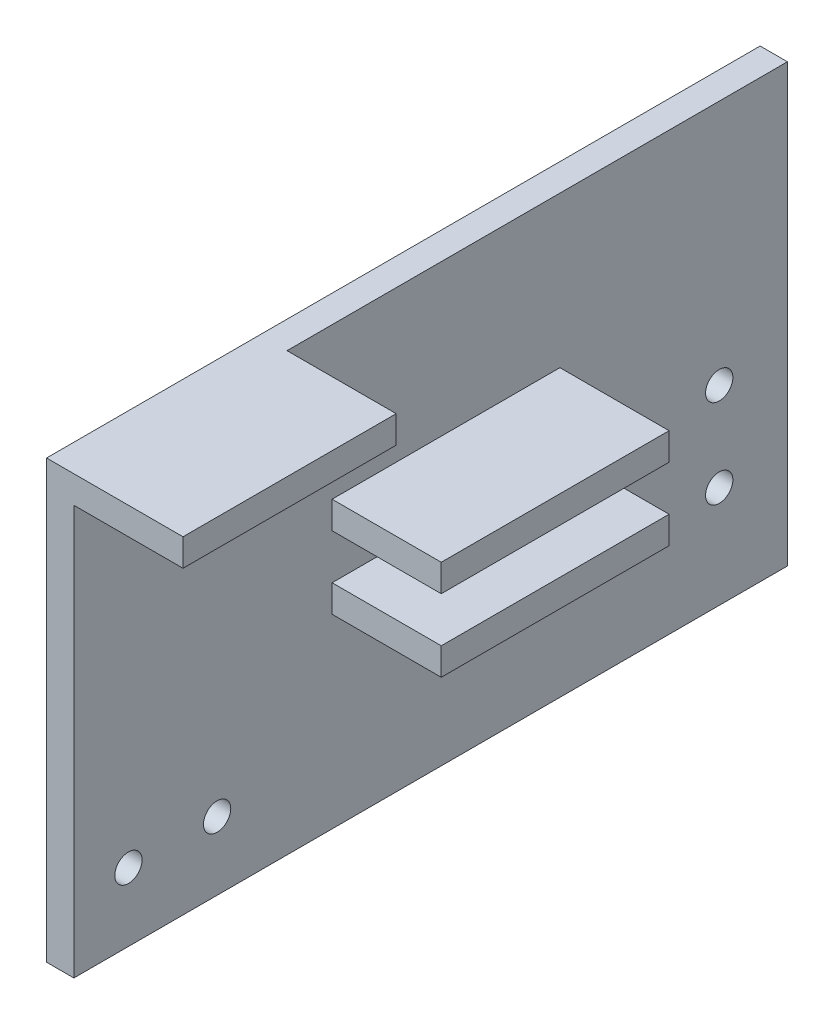
ISO-10303-21;
HEADER;
FILE_DESCRIPTION(('STEP AP214'),'2;1');
FILE_NAME('part.step','',(''),(''),'','','');
FILE_SCHEMA(('AUTOMOTIVE_DESIGN { 1 0 10303 214 1 1 1 1 }'));
ENDSEC;
DATA;
#1=APPLICATION_CONTEXT('core data for automotive mechanical design processes');
#2=APPLICATION_PROTOCOL_DEFINITION('international standard','automotive_design',2000,#1);
#3=PRODUCT_CONTEXT('',#1,'mechanical');
#4=PRODUCT('Part','Part','',(#3));
#5=PRODUCT_RELATED_PRODUCT_CATEGORY('part','',(#4));
#6=PRODUCT_DEFINITION_FORMATION('','',#4);
#7=PRODUCT_DEFINITION_CONTEXT('part definition',#1,'design');
#8=PRODUCT_DEFINITION('design','',#6,#7);
#9=PRODUCT_DEFINITION_SHAPE('','',#8);
#10=(LENGTH_UNIT() NAMED_UNIT(*) SI_UNIT(.MILLI.,.METRE.));
#11=(NAMED_UNIT(*) PLANE_ANGLE_UNIT() SI_UNIT($,.RADIAN.));
#12=(NAMED_UNIT(*) SI_UNIT($,.STERADIAN.) SOLID_ANGLE_UNIT());
#13=UNCERTAINTY_MEASURE_WITH_UNIT(LENGTH_MEASURE(1.E-05),#10,'distance_accuracy_value','');
#14=(GEOMETRIC_REPRESENTATION_CONTEXT(3) GLOBAL_UNCERTAINTY_ASSIGNED_CONTEXT((#13)) GLOBAL_UNIT_ASSIGNED_CONTEXT((#10,
#11,#12)) REPRESENTATION_CONTEXT('',''));
#15=CARTESIAN_POINT('',(0.,0.,0.));
#16=DIRECTION('',(0.,0.,1.));
#17=DIRECTION('',(1.,0.,0.));
#18=AXIS2_PLACEMENT_3D('',#15,#16,#17);
#19=CARTESIAN_POINT('',(2.,14.73202564,0.));
#20=DIRECTION('',(0.,-1.,0.));
#21=DIRECTION('',(0.,0.,-1.));
#22=AXIS2_PLACEMENT_3D('',#19,#20,#21);
#23=PLANE('',#22);
#24=DIRECTION('',(0.,0.,1.));
#25=VECTOR('',#24,1.);
#26=CARTESIAN_POINT('',(0.,14.73202564,0.));
#27=LINE('',#26,#25);
#28=CARTESIAN_POINT('',(0.,14.73202564,-52.3));
#29=VERTEX_POINT('',#28);
#30=CARTESIAN_POINT('',(0.,14.73202564,0.));
#31=VERTEX_POINT('',#30);
#32=EDGE_CURVE('E324',#29,#31,#27,.T.);
#33=ORIENTED_EDGE('',*,*,#32,.T.);
#34=DIRECTION('',(-1.,0.,0.));
#35=VECTOR('',#34,1.);
#36=CARTESIAN_POINT('',(2.,14.73202564,0.));
#37=LINE('',#36,#35);
#38=CARTESIAN_POINT('',(10.,14.73202564,0.));
#39=VERTEX_POINT('',#38);
#40=EDGE_CURVE('E11',#39,#31,#37,.T.);
#41=ORIENTED_EDGE('',*,*,#40,.F.);
#42=DIRECTION('',(0.,0.,1.));
#43=VECTOR('',#42,1.);
#44=CARTESIAN_POINT('',(10.,14.73202564,0.));
#45=LINE('',#44,#43);
#46=CARTESIAN_POINT('',(10.,14.73202564,-15.625));
#47=VERTEX_POINT('',#46);
#48=EDGE_CURVE('E249',#47,#39,#45,.T.);
#49=ORIENTED_EDGE('',*,*,#48,.F.);
#50=DIRECTION('',(-1.,0.,0.));
#51=VECTOR('',#50,1.);
#52=CARTESIAN_POINT('',(10.,14.73202564,-15.625));
#53=LINE('',#52,#51);
#54=CARTESIAN_POINT('',(2.,14.73202564,-15.625));
#55=VERTEX_POINT('',#54);
#56=EDGE_CURVE('E266',#47,#55,#53,.T.);
#57=ORIENTED_EDGE('',*,*,#56,.T.);
#58=DIRECTION('',(0.,0.,1.));
#59=VECTOR('',#58,1.);
#60=CARTESIAN_POINT('',(2.,14.73202564,0.));
#61=LINE('',#60,#59);
#62=CARTESIAN_POINT('',(2.,14.73202564,-52.3));
#63=VERTEX_POINT('',#62);
#64=EDGE_CURVE('E295',#63,#55,#61,.T.);
#65=ORIENTED_EDGE('',*,*,#64,.F.);
#66=DIRECTION('',(-1.,0.,0.));
#67=VECTOR('',#66,1.);
#68=CARTESIAN_POINT('',(2.,14.73202564,-52.3));
#69=LINE('',#68,#67);
#70=EDGE_CURVE('E308',#63,#29,#69,.T.);
#71=ORIENTED_EDGE('',*,*,#70,.T.);
#72=EDGE_LOOP('',(#33,#41,#49,#57,#65,#71));
#73=FACE_BOUND('',#72,.T.);
#74=ADVANCED_FACE('F41',(#73),#23,.F.);
#75=CARTESIAN_POINT('',(2.,0.,0.));
#76=DIRECTION('',(0.,0.,-1.));
#77=DIRECTION('',(0.,1.,0.));
#78=AXIS2_PLACEMENT_3D('',#75,#76,#77);
#79=PLANE('',#78);
#80=DIRECTION('',(0.,-1.,0.));
#81=VECTOR('',#80,1.);
#82=CARTESIAN_POINT('',(0.,0.,0.));
#83=LINE('',#82,#81);
#84=CARTESIAN_POINT('',(0.,-17.27497436,0.));
#85=VERTEX_POINT('',#84);
#86=EDGE_CURVE('E327',#31,#85,#83,.T.);
#87=ORIENTED_EDGE('',*,*,#86,.T.);
#88=DIRECTION('',(-1.,0.,0.));
#89=VECTOR('',#88,1.);
#90=CARTESIAN_POINT('',(2.,-17.27497436,0.));
#91=LINE('',#90,#89);
#92=CARTESIAN_POINT('',(2.,-17.27497436,0.));
#93=VERTEX_POINT('',#92);
#94=EDGE_CURVE('E50',#93,#85,#91,.T.);
#95=ORIENTED_EDGE('',*,*,#94,.F.);
#96=DIRECTION('',(0.,-1.,0.));
#97=VECTOR('',#96,1.);
#98=CARTESIAN_POINT('',(2.,0.,0.));
#99=LINE('',#98,#97);
#100=CARTESIAN_POINT('',(2.,12.73202564,0.));
#101=VERTEX_POINT('',#100);
#102=EDGE_CURVE('E299',#101,#93,#99,.T.);
#103=ORIENTED_EDGE('',*,*,#102,.F.);
#104=DIRECTION('',(-1.,0.,0.));
#105=VECTOR('',#104,1.);
#106=CARTESIAN_POINT('',(10.,12.73202564,0.));
#107=LINE('',#106,#105);
#108=CARTESIAN_POINT('',(10.,12.73202564,0.));
#109=VERTEX_POINT('',#108);
#110=EDGE_CURVE('E263',#109,#101,#107,.T.);
#111=ORIENTED_EDGE('',*,*,#110,.F.);
#112=DIRECTION('',(0.,-1.,0.));
#113=VECTOR('',#112,1.);
#114=CARTESIAN_POINT('',(10.,0.,0.));
#115=LINE('',#114,#113);
#116=EDGE_CURVE('E253',#39,#109,#115,.T.);
#117=ORIENTED_EDGE('',*,*,#116,.F.);
#118=ORIENTED_EDGE('',*,*,#40,.T.);
#119=EDGE_LOOP('',(#87,#95,#103,#111,#117,#118));
#120=FACE_BOUND('',#119,.T.);
#121=ADVANCED_FACE('F369',(#120),#79,.F.);
#122=CARTESIAN_POINT('',(2.,-17.27497436,0.));
#123=DIRECTION('',(0.,1.,0.));
#124=DIRECTION('',(0.,0.,1.));
#125=AXIS2_PLACEMENT_3D('',#122,#123,#124);
#126=PLANE('',#125);
#127=DIRECTION('',(0.,0.,-1.));
#128=VECTOR('',#127,1.);
#129=CARTESIAN_POINT('',(0.,-17.27497436,0.));
#130=LINE('',#129,#128);
#131=CARTESIAN_POINT('',(0.,-17.27497436,-52.3));
#132=VERTEX_POINT('',#131);
#133=EDGE_CURVE('E330',#85,#132,#130,.T.);
#134=ORIENTED_EDGE('',*,*,#133,.T.);
#135=DIRECTION('',(-1.,0.,0.));
#136=VECTOR('',#135,1.);
#137=CARTESIAN_POINT('',(2.,-17.27497436,-52.3));
#138=LINE('',#137,#136);
#139=CARTESIAN_POINT('',(2.,-17.27497436,-52.3));
#140=VERTEX_POINT('',#139);
#141=EDGE_CURVE('E338',#140,#132,#138,.T.);
#142=ORIENTED_EDGE('',*,*,#141,.F.);
#143=DIRECTION('',(0.,0.,-1.));
#144=VECTOR('',#143,1.);
#145=CARTESIAN_POINT('',(2.,-17.27497436,0.));
#146=LINE('',#145,#144);
#147=EDGE_CURVE('E302',#93,#140,#146,.T.);
#148=ORIENTED_EDGE('',*,*,#147,.F.);
#149=ORIENTED_EDGE('',*,*,#94,.T.);
#150=EDGE_LOOP('',(#134,#142,#148,#149));
#151=FACE_BOUND('',#150,.T.);
#152=ADVANCED_FACE('F347',(#151),#126,.F.);
#153=CARTESIAN_POINT('',(2.,-12.27497436,-4.00000000000001));
#154=DIRECTION('',(-1.,0.,0.));
#155=DIRECTION('',(0.,0.,1.));
#156=AXIS2_PLACEMENT_3D('',#153,#154,#155);
#157=CYLINDRICAL_SURFACE('',#156,1.);
#158=CARTESIAN_POINT('',(2.,-12.27497436,-4.00000000000001));
#159=DIRECTION('',(1.,0.,0.));
#160=DIRECTION('',(0.,0.,-1.));
#161=AXIS2_PLACEMENT_3D('',#158,#159,#160);
#162=CIRCLE('',#161,1.);
#163=CARTESIAN_POINT('',(2.,-12.27497436,-5.00000000000001));
#164=VERTEX_POINT('',#163);
#165=EDGE_CURVE('E291',#164,#164,#162,.T.);
#166=ORIENTED_EDGE('',*,*,#165,.T.);
#167=EDGE_LOOP('',(#166));
#168=FACE_BOUND('',#167,.T.);
#169=CARTESIAN_POINT('',(0.,-12.27497436,-4.00000000000001));
#170=DIRECTION('',(1.,0.,0.));
#171=DIRECTION('',(0.,0.,-1.));
#172=AXIS2_PLACEMENT_3D('',#169,#170,#171);
#173=CIRCLE('',#172,1.);
#174=CARTESIAN_POINT('',(0.,-12.27497436,-5.00000000000001));
#175=VERTEX_POINT('',#174);
#176=EDGE_CURVE('E320',#175,#175,#173,.T.);
#177=ORIENTED_EDGE('',*,*,#176,.F.);
#178=EDGE_LOOP('',(#177));
#179=FACE_BOUND('',#178,.T.);
#180=ADVANCED_FACE('F397',(#168,#179),#157,.F.);
#181=CARTESIAN_POINT('',(2.,-12.27497436,-10.5));
#182=DIRECTION('',(-1.,0.,0.));
#183=DIRECTION('',(0.,0.,1.));
#184=AXIS2_PLACEMENT_3D('',#181,#182,#183);
#185=CYLINDRICAL_SURFACE('',#184,1.);
#186=CARTESIAN_POINT('',(2.,-12.27497436,-10.5));
#187=DIRECTION('',(1.,0.,0.));
#188=DIRECTION('',(0.,0.,-1.));
#189=AXIS2_PLACEMENT_3D('',#186,#187,#188);
#190=CIRCLE('',#189,1.);
#191=CARTESIAN_POINT('',(2.,-12.27497436,-11.5));
#192=VERTEX_POINT('',#191);
#193=EDGE_CURVE('E287',#192,#192,#190,.T.);
#194=ORIENTED_EDGE('',*,*,#193,.T.);
#195=EDGE_LOOP('',(#194));
#196=FACE_BOUND('',#195,.T.);
#197=CARTESIAN_POINT('',(0.,-12.27497436,-10.5));
#198=DIRECTION('',(1.,0.,0.));
#199=DIRECTION('',(0.,0.,-1.));
#200=AXIS2_PLACEMENT_3D('',#197,#198,#199);
#201=CIRCLE('',#200,1.);
#202=CARTESIAN_POINT('',(0.,-12.27497436,-11.5));
#203=VERTEX_POINT('',#202);
#204=EDGE_CURVE('E316',#203,#203,#201,.T.);
#205=ORIENTED_EDGE('',*,*,#204,.F.);
#206=EDGE_LOOP('',(#205));
#207=FACE_BOUND('',#206,.T.);
#208=ADVANCED_FACE('F400',(#196,#207),#185,.F.);
#209=CARTESIAN_POINT('',(2.,-9.79999999999999,-47.3));
#210=DIRECTION('',(-1.,0.,0.));
#211=DIRECTION('',(0.,0.,1.));
#212=AXIS2_PLACEMENT_3D('',#209,#210,#211);
#213=CYLINDRICAL_SURFACE('',#212,0.999999999999998);
#214=CARTESIAN_POINT('',(2.,-9.79999999999999,-47.3));
#215=DIRECTION('',(1.,0.,0.));
#216=DIRECTION('',(0.,0.,-1.));
#217=AXIS2_PLACEMENT_3D('',#214,#215,#216);
#218=CIRCLE('',#217,0.999999999999998);
#219=CARTESIAN_POINT('',(2.,-9.79999999999999,-48.3));
#220=VERTEX_POINT('',#219);
#221=EDGE_CURVE('E282',#220,#220,#218,.T.);
#222=ORIENTED_EDGE('',*,*,#221,.T.);
#223=EDGE_LOOP('',(#222));
#224=FACE_BOUND('',#223,.T.);
#225=CARTESIAN_POINT('',(0.,-9.79999999999999,-47.3));
#226=DIRECTION('',(1.,0.,0.));
#227=DIRECTION('',(0.,0.,-1.));
#228=AXIS2_PLACEMENT_3D('',#225,#226,#227);
#229=CIRCLE('',#228,0.999999999999998);
#230=CARTESIAN_POINT('',(0.,-9.79999999999999,-48.3));
#231=VERTEX_POINT('',#230);
#232=EDGE_CURVE('E312',#231,#231,#229,.T.);
#233=ORIENTED_EDGE('',*,*,#232,.F.);
#234=EDGE_LOOP('',(#233));
#235=FACE_BOUND('',#234,.T.);
#236=ADVANCED_FACE('F403',(#224,#235),#213,.F.);
#237=CARTESIAN_POINT('',(2.,-3.3,-47.3));
#238=DIRECTION('',(-1.,0.,0.));
#239=DIRECTION('',(0.,0.,1.));
#240=AXIS2_PLACEMENT_3D('',#237,#238,#239);
#241=CYLINDRICAL_SURFACE('',#240,0.999999999999998);
#242=CARTESIAN_POINT('',(2.,-3.3,-47.3));
#243=DIRECTION('',(1.,0.,0.));
#244=DIRECTION('',(0.,0.,-1.));
#245=AXIS2_PLACEMENT_3D('',#242,#243,#244);
#246=CIRCLE('',#245,0.999999999999998);
#247=CARTESIAN_POINT('',(2.,-3.3,-48.3));
#248=VERTEX_POINT('',#247);
#249=EDGE_CURVE('E278',#248,#248,#246,.T.);
#250=ORIENTED_EDGE('',*,*,#249,.T.);
#251=EDGE_LOOP('',(#250));
#252=FACE_BOUND('',#251,.T.);
#253=CARTESIAN_POINT('',(0.,-3.3,-47.3));
#254=DIRECTION('',(1.,0.,0.));
#255=DIRECTION('',(0.,0.,-1.));
#256=AXIS2_PLACEMENT_3D('',#253,#254,#255);
#257=CIRCLE('',#256,0.999999999999998);
#258=CARTESIAN_POINT('',(0.,-3.3,-48.3));
#259=VERTEX_POINT('',#258);
#260=EDGE_CURVE('E277',#259,#259,#257,.T.);
#261=ORIENTED_EDGE('',*,*,#260,.F.);
#262=EDGE_LOOP('',(#261));
#263=FACE_BOUND('',#262,.T.);
#264=ADVANCED_FACE('F43',(#252,#263),#241,.F.);
#265=CARTESIAN_POINT('',(2.,0.,-52.3));
#266=DIRECTION('',(0.,0.,1.));
#267=DIRECTION('',(1.,0.,0.));
#268=AXIS2_PLACEMENT_3D('',#265,#266,#267);
#269=PLANE('',#268);
#270=DIRECTION('',(0.,1.,0.));
#271=VECTOR('',#270,1.);
#272=CARTESIAN_POINT('',(0.,0.,-52.3));
#273=LINE('',#272,#271);
#274=EDGE_CURVE('E283',#132,#29,#273,.T.);
#275=ORIENTED_EDGE('',*,*,#274,.T.);
#276=ORIENTED_EDGE('',*,*,#70,.F.);
#277=DIRECTION('',(0.,1.,0.));
#278=VECTOR('',#277,1.);
#279=CARTESIAN_POINT('',(2.,0.,-52.3));
#280=LINE('',#279,#278);
#281=EDGE_CURVE('E305',#140,#63,#280,.T.);
#282=ORIENTED_EDGE('',*,*,#281,.F.);
#283=ORIENTED_EDGE('',*,*,#141,.T.);
#284=EDGE_LOOP('',(#275,#276,#282,#283));
#285=FACE_BOUND('',#284,.T.);
#286=ADVANCED_FACE('F359',(#285),#269,.F.);
#287=CARTESIAN_POINT('',(2.,0.,0.));
#288=DIRECTION('',(1.,0.,0.));
#289=DIRECTION('',(0.,0.,-1.));
#290=AXIS2_PLACEMENT_3D('',#287,#288,#289);
#291=PLANE('',#290);
#292=DIRECTION('',(0.,1.,0.));
#293=VECTOR('',#292,1.);
#294=CARTESIAN_POINT('',(2.,0.,-35.625));
#295=LINE('',#294,#293);
#296=CARTESIAN_POINT('',(2.,-3.651,-35.625));
#297=VERTEX_POINT('',#296);
#298=CARTESIAN_POINT('',(2.,-1.651,-35.625));
#299=VERTEX_POINT('',#298);
#300=EDGE_CURVE('E157',#297,#299,#295,.T.);
#301=ORIENTED_EDGE('',*,*,#300,.F.);
#302=DIRECTION('',(0.,0.,1.));
#303=VECTOR('',#302,1.);
#304=CARTESIAN_POINT('',(2.,-3.651,0.));
#305=LINE('',#304,#303);
#306=CARTESIAN_POINT('',(2.,-3.651,-18.927));
#307=VERTEX_POINT('',#306);
#308=EDGE_CURVE('E162',#297,#307,#305,.T.);
#309=ORIENTED_EDGE('',*,*,#308,.T.);
#310=DIRECTION('',(0.,1.,0.));
#311=VECTOR('',#310,1.);
#312=CARTESIAN_POINT('',(2.,0.,-18.927));
#313=LINE('',#312,#311);
#314=CARTESIAN_POINT('',(2.,-1.651,-18.927));
#315=VERTEX_POINT('',#314);
#316=EDGE_CURVE('E194',#307,#315,#313,.T.);
#317=ORIENTED_EDGE('',*,*,#316,.T.);
#318=DIRECTION('',(0.,0.,1.));
#319=VECTOR('',#318,1.);
#320=CARTESIAN_POINT('',(2.,-1.651,0.));
#321=LINE('',#320,#319);
#322=EDGE_CURVE('E198',#299,#315,#321,.T.);
#323=ORIENTED_EDGE('',*,*,#322,.F.);
#324=EDGE_LOOP('',(#301,#309,#317,#323));
#325=FACE_BOUND('',#324,.T.);
#326=DIRECTION('',(0.,1.,0.));
#327=VECTOR('',#326,1.);
#328=CARTESIAN_POINT('',(2.,0.,-35.625));
#329=LINE('',#328,#327);
#330=CARTESIAN_POINT('',(2.,1.651,-35.625));
#331=VERTEX_POINT('',#330);
#332=CARTESIAN_POINT('',(2.,3.651,-35.625));
#333=VERTEX_POINT('',#332);
#334=EDGE_CURVE('E242',#331,#333,#329,.T.);
#335=ORIENTED_EDGE('',*,*,#334,.F.);
#336=DIRECTION('',(0.,0.,1.));
#337=VECTOR('',#336,1.);
#338=CARTESIAN_POINT('',(2.,1.651,0.));
#339=LINE('',#338,#337);
#340=CARTESIAN_POINT('',(2.,1.651,-18.927));
#341=VERTEX_POINT('',#340);
#342=EDGE_CURVE('E231',#331,#341,#339,.T.);
#343=ORIENTED_EDGE('',*,*,#342,.T.);
#344=DIRECTION('',(0.,1.,0.));
#345=VECTOR('',#344,1.);
#346=CARTESIAN_POINT('',(2.,0.,-18.927));
#347=LINE('',#346,#345);
#348=CARTESIAN_POINT('',(2.,3.651,-18.927));
#349=VERTEX_POINT('',#348);
#350=EDGE_CURVE('E235',#341,#349,#347,.T.);
#351=ORIENTED_EDGE('',*,*,#350,.T.);
#352=DIRECTION('',(0.,0.,1.));
#353=VECTOR('',#352,1.);
#354=CARTESIAN_POINT('',(2.,3.651,0.));
#355=LINE('',#354,#353);
#356=EDGE_CURVE('E239',#333,#349,#355,.T.);
#357=ORIENTED_EDGE('',*,*,#356,.F.);
#358=EDGE_LOOP('',(#335,#343,#351,#357));
#359=FACE_BOUND('',#358,.T.);
#360=DIRECTION('',(0.,1.,0.));
#361=VECTOR('',#360,1.);
#362=CARTESIAN_POINT('',(2.,0.,-15.625));
#363=LINE('',#362,#361);
#364=CARTESIAN_POINT('',(2.,12.73202564,-15.625));
#365=VERTEX_POINT('',#364);
#366=EDGE_CURVE('E274',#365,#55,#363,.T.);
#367=ORIENTED_EDGE('',*,*,#366,.F.);
#368=DIRECTION('',(0.,0.,1.));
#369=VECTOR('',#368,1.);
#370=CARTESIAN_POINT('',(2.,12.73202564,0.));
#371=LINE('',#370,#369);
#372=EDGE_CURVE('E270',#365,#101,#371,.T.);
#373=ORIENTED_EDGE('',*,*,#372,.T.);
#374=ORIENTED_EDGE('',*,*,#102,.T.);
#375=ORIENTED_EDGE('',*,*,#147,.T.);
#376=ORIENTED_EDGE('',*,*,#281,.T.);
#377=ORIENTED_EDGE('',*,*,#64,.T.);
#378=EDGE_LOOP('',(#367,#373,#374,#375,#376,#377));
#379=FACE_BOUND('',#378,.T.);
#380=ORIENTED_EDGE('',*,*,#249,.F.);
#381=EDGE_LOOP('',(#380));
#382=FACE_BOUND('',#381,.T.);
#383=ORIENTED_EDGE('',*,*,#221,.F.);
#384=EDGE_LOOP('',(#383));
#385=FACE_BOUND('',#384,.T.);
#386=ORIENTED_EDGE('',*,*,#193,.F.);
#387=EDGE_LOOP('',(#386));
#388=FACE_BOUND('',#387,.T.);
#389=ORIENTED_EDGE('',*,*,#165,.F.);
#390=EDGE_LOOP('',(#389));
#391=FACE_BOUND('',#390,.T.);
#392=ADVANCED_FACE('F366',(#325,#359,#379,#382,#385,#388,#391),#291,.T.);
#393=CARTESIAN_POINT('',(0.,0.,0.));
#394=DIRECTION('',(1.,0.,0.));
#395=DIRECTION('',(0.,0.,-1.));
#396=AXIS2_PLACEMENT_3D('',#393,#394,#395);
#397=PLANE('',#396);
#398=ORIENTED_EDGE('',*,*,#86,.F.);
#399=ORIENTED_EDGE('',*,*,#32,.F.);
#400=ORIENTED_EDGE('',*,*,#274,.F.);
#401=ORIENTED_EDGE('',*,*,#133,.F.);
#402=EDGE_LOOP('',(#398,#399,#400,#401));
#403=FACE_BOUND('',#402,.T.);
#404=ORIENTED_EDGE('',*,*,#260,.T.);
#405=EDGE_LOOP('',(#404));
#406=FACE_BOUND('',#405,.T.);
#407=ORIENTED_EDGE('',*,*,#232,.T.);
#408=EDGE_LOOP('',(#407));
#409=FACE_BOUND('',#408,.T.);
#410=ORIENTED_EDGE('',*,*,#204,.T.);
#411=EDGE_LOOP('',(#410));
#412=FACE_BOUND('',#411,.T.);
#413=ORIENTED_EDGE('',*,*,#176,.T.);
#414=EDGE_LOOP('',(#413));
#415=FACE_BOUND('',#414,.T.);
#416=ADVANCED_FACE('F354',(#403,#406,#409,#412,#415),#397,.F.);
#417=CARTESIAN_POINT('',(10.,0.,-15.625));
#418=DIRECTION('',(0.,0.,-1.));
#419=DIRECTION('',(0.,1.,0.));
#420=AXIS2_PLACEMENT_3D('',#417,#418,#419);
#421=PLANE('',#420);
#422=DIRECTION('',(-1.,0.,0.));
#423=VECTOR('',#422,1.);
#424=CARTESIAN_POINT('',(10.,12.73202564,-15.625));
#425=LINE('',#424,#423);
#426=CARTESIAN_POINT('',(10.,12.73202564,-15.625));
#427=VERTEX_POINT('',#426);
#428=EDGE_CURVE('E259',#427,#365,#425,.T.);
#429=ORIENTED_EDGE('',*,*,#428,.T.);
#430=ORIENTED_EDGE('',*,*,#366,.T.);
#431=ORIENTED_EDGE('',*,*,#56,.F.);
#432=DIRECTION('',(0.,-1.,0.));
#433=VECTOR('',#432,1.);
#434=CARTESIAN_POINT('',(10.,0.,-15.625));
#435=LINE('',#434,#433);
#436=EDGE_CURVE('E245',#47,#427,#435,.T.);
#437=ORIENTED_EDGE('',*,*,#436,.T.);
#438=EDGE_LOOP('',(#429,#430,#431,#437));
#439=FACE_BOUND('',#438,.T.);
#440=ADVANCED_FACE('F379',(#439),#421,.T.);
#441=CARTESIAN_POINT('',(10.,12.73202564,0.));
#442=DIRECTION('',(0.,1.,0.));
#443=DIRECTION('',(0.,0.,1.));
#444=AXIS2_PLACEMENT_3D('',#441,#442,#443);
#445=PLANE('',#444);
#446=ORIENTED_EDGE('',*,*,#372,.F.);
#447=ORIENTED_EDGE('',*,*,#428,.F.);
#448=DIRECTION('',(0.,0.,-1.));
#449=VECTOR('',#448,1.);
#450=CARTESIAN_POINT('',(10.,12.73202564,0.));
#451=LINE('',#450,#449);
#452=EDGE_CURVE('E256',#109,#427,#451,.T.);
#453=ORIENTED_EDGE('',*,*,#452,.F.);
#454=ORIENTED_EDGE('',*,*,#110,.T.);
#455=EDGE_LOOP('',(#446,#447,#453,#454));
#456=FACE_BOUND('',#455,.T.);
#457=ADVANCED_FACE('F374',(#456),#445,.F.);
#458=CARTESIAN_POINT('',(10.,0.,0.));
#459=DIRECTION('',(1.,0.,0.));
#460=DIRECTION('',(0.,0.,-1.));
#461=AXIS2_PLACEMENT_3D('',#458,#459,#460);
#462=PLANE('',#461);
#463=ORIENTED_EDGE('',*,*,#436,.F.);
#464=ORIENTED_EDGE('',*,*,#48,.T.);
#465=ORIENTED_EDGE('',*,*,#116,.T.);
#466=ORIENTED_EDGE('',*,*,#452,.T.);
#467=EDGE_LOOP('',(#463,#464,#465,#466));
#468=FACE_BOUND('',#467,.T.);
#469=ADVANCED_FACE('F377',(#468),#462,.T.);
#470=CARTESIAN_POINT('',(10.,0.,-35.625));
#471=DIRECTION('',(0.,0.,-1.));
#472=DIRECTION('',(-1.,0.,0.));
#473=AXIS2_PLACEMENT_3D('',#470,#471,#472);
#474=PLANE('',#473);
#475=DIRECTION('',(-1.,0.,0.));
#476=VECTOR('',#475,1.);
#477=CARTESIAN_POINT('',(10.,1.651,-35.625));
#478=LINE('',#477,#476);
#479=CARTESIAN_POINT('',(10.,1.651,-35.625));
#480=VERTEX_POINT('',#479);
#481=EDGE_CURVE('E217',#480,#331,#478,.T.);
#482=ORIENTED_EDGE('',*,*,#481,.T.);
#483=ORIENTED_EDGE('',*,*,#334,.T.);
#484=DIRECTION('',(-1.,0.,0.));
#485=VECTOR('',#484,1.);
#486=CARTESIAN_POINT('',(10.,3.651,-35.625));
#487=LINE('',#486,#485);
#488=CARTESIAN_POINT('',(10.,3.651,-35.625));
#489=VERTEX_POINT('',#488);
#490=EDGE_CURVE('E227',#489,#333,#487,.T.);
#491=ORIENTED_EDGE('',*,*,#490,.F.);
#492=DIRECTION('',(0.,-1.,0.));
#493=VECTOR('',#492,1.);
#494=CARTESIAN_POINT('',(10.,0.,-35.625));
#495=LINE('',#494,#493);
#496=EDGE_CURVE('E203',#489,#480,#495,.T.);
#497=ORIENTED_EDGE('',*,*,#496,.T.);
#498=EDGE_LOOP('',(#482,#483,#491,#497));
#499=FACE_BOUND('',#498,.T.);
#500=ADVANCED_FACE('F503',(#499),#474,.T.);
#501=CARTESIAN_POINT('',(10.,3.651,0.));
#502=DIRECTION('',(0.,1.,0.));
#503=DIRECTION('',(0.,0.,1.));
#504=AXIS2_PLACEMENT_3D('',#501,#502,#503);
#505=PLANE('',#504);
#506=ORIENTED_EDGE('',*,*,#490,.T.);
#507=ORIENTED_EDGE('',*,*,#356,.T.);
#508=DIRECTION('',(-1.,0.,0.));
#509=VECTOR('',#508,1.);
#510=CARTESIAN_POINT('',(10.,3.651,-18.927));
#511=LINE('',#510,#509);
#512=CARTESIAN_POINT('',(10.,3.651,-18.927));
#513=VERTEX_POINT('',#512);
#514=EDGE_CURVE('E223',#513,#349,#511,.T.);
#515=ORIENTED_EDGE('',*,*,#514,.F.);
#516=DIRECTION('',(0.,0.,-1.));
#517=VECTOR('',#516,1.);
#518=CARTESIAN_POINT('',(10.,3.651,0.));
#519=LINE('',#518,#517);
#520=EDGE_CURVE('E207',#513,#489,#519,.T.);
#521=ORIENTED_EDGE('',*,*,#520,.T.);
#522=EDGE_LOOP('',(#506,#507,#515,#521));
#523=FACE_BOUND('',#522,.T.);
#524=ADVANCED_FACE('F512',(#523),#505,.T.);
#525=CARTESIAN_POINT('',(10.,0.,-18.927));
#526=DIRECTION('',(0.,0.,-1.));
#527=DIRECTION('',(-1.,0.,0.));
#528=AXIS2_PLACEMENT_3D('',#525,#526,#527);
#529=PLANE('',#528);
#530=ORIENTED_EDGE('',*,*,#350,.F.);
#531=DIRECTION('',(-1.,0.,0.));
#532=VECTOR('',#531,1.);
#533=CARTESIAN_POINT('',(10.,1.651,-18.927));
#534=LINE('',#533,#532);
#535=CARTESIAN_POINT('',(10.,1.651,-18.927));
#536=VERTEX_POINT('',#535);
#537=EDGE_CURVE('E65',#536,#341,#534,.T.);
#538=ORIENTED_EDGE('',*,*,#537,.F.);
#539=DIRECTION('',(0.,-1.,0.));
#540=VECTOR('',#539,1.);
#541=CARTESIAN_POINT('',(10.,0.,-18.927));
#542=LINE('',#541,#540);
#543=EDGE_CURVE('E211',#513,#536,#542,.T.);
#544=ORIENTED_EDGE('',*,*,#543,.F.);
#545=ORIENTED_EDGE('',*,*,#514,.T.);
#546=EDGE_LOOP('',(#530,#538,#544,#545));
#547=FACE_BOUND('',#546,.T.);
#548=ADVANCED_FACE('F522',(#547),#529,.F.);
#549=CARTESIAN_POINT('',(10.,1.651,0.));
#550=DIRECTION('',(0.,1.,0.));
#551=DIRECTION('',(0.,0.,1.));
#552=AXIS2_PLACEMENT_3D('',#549,#550,#551);
#553=PLANE('',#552);
#554=ORIENTED_EDGE('',*,*,#342,.F.);
#555=ORIENTED_EDGE('',*,*,#481,.F.);
#556=DIRECTION('',(0.,0.,-1.));
#557=VECTOR('',#556,1.);
#558=CARTESIAN_POINT('',(10.,1.651,0.));
#559=LINE('',#558,#557);
#560=EDGE_CURVE('E214',#536,#480,#559,.T.);
#561=ORIENTED_EDGE('',*,*,#560,.F.);
#562=ORIENTED_EDGE('',*,*,#537,.T.);
#563=EDGE_LOOP('',(#554,#555,#561,#562));
#564=FACE_BOUND('',#563,.T.);
#565=ADVANCED_FACE('F532',(#564),#553,.F.);
#566=CARTESIAN_POINT('',(10.,0.,0.));
#567=DIRECTION('',(1.,0.,0.));
#568=DIRECTION('',(0.,0.,-1.));
#569=AXIS2_PLACEMENT_3D('',#566,#567,#568);
#570=PLANE('',#569);
#571=ORIENTED_EDGE('',*,*,#496,.F.);
#572=ORIENTED_EDGE('',*,*,#520,.F.);
#573=ORIENTED_EDGE('',*,*,#543,.T.);
#574=ORIENTED_EDGE('',*,*,#560,.T.);
#575=EDGE_LOOP('',(#571,#572,#573,#574));
#576=FACE_BOUND('',#575,.T.);
#577=ADVANCED_FACE('F542',(#576),#570,.T.);
#578=CARTESIAN_POINT('',(10.,0.,-35.625));
#579=DIRECTION('',(0.,0.,-1.));
#580=DIRECTION('',(-1.,0.,0.));
#581=AXIS2_PLACEMENT_3D('',#578,#579,#580);
#582=PLANE('',#581);
#583=DIRECTION('',(-1.,0.,0.));
#584=VECTOR('',#583,1.);
#585=CARTESIAN_POINT('',(10.,-3.651,-35.625));
#586=LINE('',#585,#584);
#587=CARTESIAN_POINT('',(10.,-3.651,-35.625));
#588=VERTEX_POINT('',#587);
#589=EDGE_CURVE('E184',#588,#297,#586,.T.);
#590=ORIENTED_EDGE('',*,*,#589,.T.);
#591=ORIENTED_EDGE('',*,*,#300,.T.);
#592=DIRECTION('',(-1.,0.,0.));
#593=VECTOR('',#592,1.);
#594=CARTESIAN_POINT('',(10.,-1.651,-35.625));
#595=LINE('',#594,#593);
#596=CARTESIAN_POINT('',(10.,-1.651,-35.625));
#597=VERTEX_POINT('',#596);
#598=EDGE_CURVE('E151',#597,#299,#595,.T.);
#599=ORIENTED_EDGE('',*,*,#598,.F.);
#600=DIRECTION('',(0.,-1.,0.));
#601=VECTOR('',#600,1.);
#602=CARTESIAN_POINT('',(10.,0.,-35.625));
#603=LINE('',#602,#601);
#604=EDGE_CURVE('E155',#597,#588,#603,.T.);
#605=ORIENTED_EDGE('',*,*,#604,.T.);
#606=EDGE_LOOP('',(#590,#591,#599,#605));
#607=FACE_BOUND('',#606,.T.);
#608=ADVANCED_FACE('F154',(#607),#582,.T.);
#609=CARTESIAN_POINT('',(10.,-1.651,0.));
#610=DIRECTION('',(0.,1.,0.));
#611=DIRECTION('',(0.,0.,1.));
#612=AXIS2_PLACEMENT_3D('',#609,#610,#611);
#613=PLANE('',#612);
#614=ORIENTED_EDGE('',*,*,#598,.T.);
#615=ORIENTED_EDGE('',*,*,#322,.T.);
#616=DIRECTION('',(-1.,0.,0.));
#617=VECTOR('',#616,1.);
#618=CARTESIAN_POINT('',(10.,-1.651,-18.927));
#619=LINE('',#618,#617);
#620=CARTESIAN_POINT('',(10.,-1.651,-18.927));
#621=VERTEX_POINT('',#620);
#622=EDGE_CURVE('E163',#621,#315,#619,.T.);
#623=ORIENTED_EDGE('',*,*,#622,.F.);
#624=DIRECTION('',(0.,0.,-1.));
#625=VECTOR('',#624,1.);
#626=CARTESIAN_POINT('',(10.,-1.651,0.));
#627=LINE('',#626,#625);
#628=EDGE_CURVE('E168',#621,#597,#627,.T.);
#629=ORIENTED_EDGE('',*,*,#628,.T.);
#630=EDGE_LOOP('',(#614,#615,#623,#629));
#631=FACE_BOUND('',#630,.T.);
#632=ADVANCED_FACE('F173',(#631),#613,.T.);
#633=CARTESIAN_POINT('',(10.,0.,-18.927));
#634=DIRECTION('',(0.,0.,-1.));
#635=DIRECTION('',(-1.,0.,0.));
#636=AXIS2_PLACEMENT_3D('',#633,#634,#635);
#637=PLANE('',#636);
#638=ORIENTED_EDGE('',*,*,#316,.F.);
#639=DIRECTION('',(-1.,0.,0.));
#640=VECTOR('',#639,1.);
#641=CARTESIAN_POINT('',(10.,-3.651,-18.927));
#642=LINE('',#641,#640);
#643=CARTESIAN_POINT('',(10.,-3.651,-18.927));
#644=VERTEX_POINT('',#643);
#645=EDGE_CURVE('E57',#644,#307,#642,.T.);
#646=ORIENTED_EDGE('',*,*,#645,.F.);
#647=DIRECTION('',(0.,-1.,0.));
#648=VECTOR('',#647,1.);
#649=CARTESIAN_POINT('',(10.,0.,-18.927));
#650=LINE('',#649,#648);
#651=EDGE_CURVE('E177',#621,#644,#650,.T.);
#652=ORIENTED_EDGE('',*,*,#651,.F.);
#653=ORIENTED_EDGE('',*,*,#622,.T.);
#654=EDGE_LOOP('',(#638,#646,#652,#653));
#655=FACE_BOUND('',#654,.T.);
#656=ADVANCED_FACE('F568',(#655),#637,.F.);
#657=CARTESIAN_POINT('',(10.,-3.651,0.));
#658=DIRECTION('',(0.,1.,0.));
#659=DIRECTION('',(0.,0.,1.));
#660=AXIS2_PLACEMENT_3D('',#657,#658,#659);
#661=PLANE('',#660);
#662=ORIENTED_EDGE('',*,*,#308,.F.);
#663=ORIENTED_EDGE('',*,*,#589,.F.);
#664=DIRECTION('',(0.,0.,-1.));
#665=VECTOR('',#664,1.);
#666=CARTESIAN_POINT('',(10.,-3.651,0.));
#667=LINE('',#666,#665);
#668=EDGE_CURVE('E169',#644,#588,#667,.T.);
#669=ORIENTED_EDGE('',*,*,#668,.F.);
#670=ORIENTED_EDGE('',*,*,#645,.T.);
#671=EDGE_LOOP('',(#662,#663,#669,#670));
#672=FACE_BOUND('',#671,.T.);
#673=ADVANCED_FACE('F577',(#672),#661,.F.);
#674=CARTESIAN_POINT('',(10.,0.,0.));
#675=DIRECTION('',(1.,0.,0.));
#676=DIRECTION('',(0.,0.,-1.));
#677=AXIS2_PLACEMENT_3D('',#674,#675,#676);
#678=PLANE('',#677);
#679=ORIENTED_EDGE('',*,*,#604,.F.);
#680=ORIENTED_EDGE('',*,*,#628,.F.);
#681=ORIENTED_EDGE('',*,*,#651,.T.);
#682=ORIENTED_EDGE('',*,*,#668,.T.);
#683=EDGE_LOOP('',(#679,#680,#681,#682));
#684=FACE_BOUND('',#683,.T.);
#685=ADVANCED_FACE('F167',(#684),#678,.T.);
#686=CLOSED_SHELL('',(#74,#121,#152,#180,#208,#236,#264,#286,#392,#416,#440,#457,#469,#500,#524,
#548,#565,#577,#608,#632,#656,#673,#685));
#687=MANIFOLD_SOLID_BREP('B2',#686);
#688=ADVANCED_BREP_SHAPE_REPRESENTATION('',(#18,#687),#14);
#689=SHAPE_DEFINITION_REPRESENTATION(#9,#688);
ENDSEC;
END-ISO-10303-21;
